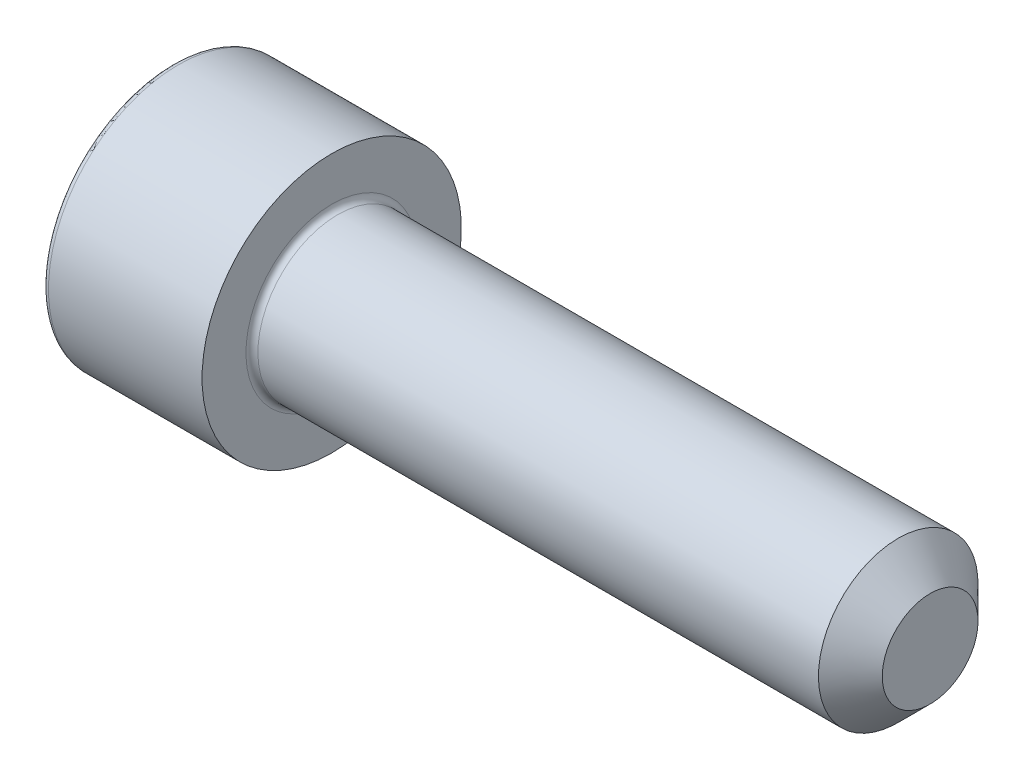
ISO-10303-21;
HEADER;
FILE_DESCRIPTION(('STEP AP214'),'2;1');
FILE_NAME('part.step','',(''),(''),'','','');
FILE_SCHEMA(('AUTOMOTIVE_DESIGN { 1 0 10303 214 1 1 1 1 }'));
ENDSEC;
DATA;
#1=APPLICATION_CONTEXT('core data for automotive mechanical design processes');
#2=APPLICATION_PROTOCOL_DEFINITION('international standard','automotive_design',2000,#1);
#3=PRODUCT_CONTEXT('',#1,'mechanical');
#4=PRODUCT('Part','Part','',(#3));
#5=PRODUCT_RELATED_PRODUCT_CATEGORY('part','',(#4));
#6=PRODUCT_DEFINITION_FORMATION('','',#4);
#7=PRODUCT_DEFINITION_CONTEXT('part definition',#1,'design');
#8=PRODUCT_DEFINITION('design','',#6,#7);
#9=PRODUCT_DEFINITION_SHAPE('','',#8);
#10=(LENGTH_UNIT() NAMED_UNIT(*) SI_UNIT(.MILLI.,.METRE.));
#11=(NAMED_UNIT(*) PLANE_ANGLE_UNIT() SI_UNIT($,.RADIAN.));
#12=(NAMED_UNIT(*) SI_UNIT($,.STERADIAN.) SOLID_ANGLE_UNIT());
#13=UNCERTAINTY_MEASURE_WITH_UNIT(LENGTH_MEASURE(1.E-05),#10,'distance_accuracy_value','');
#14=(GEOMETRIC_REPRESENTATION_CONTEXT(3) GLOBAL_UNCERTAINTY_ASSIGNED_CONTEXT((#13)) GLOBAL_UNIT_ASSIGNED_CONTEXT((#10,
#11,#12)) REPRESENTATION_CONTEXT('',''));
#15=CARTESIAN_POINT('',(0.,0.,0.));
#16=DIRECTION('',(0.,0.,1.));
#17=DIRECTION('',(1.,0.,0.));
#18=AXIS2_PLACEMENT_3D('',#15,#16,#17);
#19=CARTESIAN_POINT('',(0.,0.,0.));
#20=DIRECTION('',(-1.,0.,0.));
#21=DIRECTION('',(0.,-1.,0.));
#22=AXIS2_PLACEMENT_3D('',#19,#20,#21);
#23=PLANE('',#22);
#24=CARTESIAN_POINT('',(0.,0.,0.));
#25=DIRECTION('',(-1.,0.,0.));
#26=DIRECTION('',(0.,-1.,0.));
#27=AXIS2_PLACEMENT_3D('',#24,#25,#26);
#28=CIRCLE('',#27,6.2);
#29=CARTESIAN_POINT('',(0.,-6.2,0.));
#30=VERTEX_POINT('',#29);
#31=EDGE_CURVE('E158',#30,#30,#28,.T.);
#32=ORIENTED_EDGE('',*,*,#31,.T.);
#33=EDGE_LOOP('',(#32));
#34=FACE_BOUND('',#33,.T.);
#35=DIRECTION('',(0.,0.,-1.));
#36=VECTOR('',#35,1.);
#37=CARTESIAN_POINT('',(0.,3.,1.73205080756888));
#38=LINE('',#37,#36);
#39=CARTESIAN_POINT('',(0.,3.,1.73205080756888));
#40=VERTEX_POINT('',#39);
#41=CARTESIAN_POINT('',(0.,3.,-1.73205080756888));
#42=VERTEX_POINT('',#41);
#43=EDGE_CURVE('E54',#40,#42,#38,.T.);
#44=ORIENTED_EDGE('',*,*,#43,.F.);
#45=DIRECTION('',(0.,0.866025403784439,-0.5));
#46=VECTOR('',#45,1.);
#47=CARTESIAN_POINT('',(0.,0.,3.46410161513775));
#48=LINE('',#47,#46);
#49=CARTESIAN_POINT('',(0.,0.,3.46410161513775));
#50=VERTEX_POINT('',#49);
#51=EDGE_CURVE('E137',#50,#40,#48,.T.);
#52=ORIENTED_EDGE('',*,*,#51,.F.);
#53=DIRECTION('',(0.,0.866025403784439,0.5));
#54=VECTOR('',#53,1.);
#55=CARTESIAN_POINT('',(0.,-3.,1.73205080756888));
#56=LINE('',#55,#54);
#57=CARTESIAN_POINT('',(0.,-3.,1.73205080756888));
#58=VERTEX_POINT('',#57);
#59=EDGE_CURVE('E135',#58,#50,#56,.T.);
#60=ORIENTED_EDGE('',*,*,#59,.F.);
#61=DIRECTION('',(0.,0.,1.));
#62=VECTOR('',#61,1.);
#63=CARTESIAN_POINT('',(0.,-3.,-1.73205080756888));
#64=LINE('',#63,#62);
#65=CARTESIAN_POINT('',(0.,-3.,-1.73205080756888));
#66=VERTEX_POINT('',#65);
#67=EDGE_CURVE('E102',#66,#58,#64,.T.);
#68=ORIENTED_EDGE('',*,*,#67,.F.);
#69=DIRECTION('',(0.,-0.866025403784439,0.5));
#70=VECTOR('',#69,1.);
#71=CARTESIAN_POINT('',(0.,0.,-3.46410161513775));
#72=LINE('',#71,#70);
#73=CARTESIAN_POINT('',(0.,0.,-3.46410161513775));
#74=VERTEX_POINT('',#73);
#75=EDGE_CURVE('E131',#74,#66,#72,.T.);
#76=ORIENTED_EDGE('',*,*,#75,.F.);
#77=DIRECTION('',(0.,-0.866025403784438,-0.5));
#78=VECTOR('',#77,1.);
#79=CARTESIAN_POINT('',(0.,3.,-1.73205080756888));
#80=LINE('',#79,#78);
#81=EDGE_CURVE('E128',#42,#74,#80,.T.);
#82=ORIENTED_EDGE('',*,*,#81,.F.);
#83=EDGE_LOOP('',(#44,#52,#60,#68,#76,#82));
#84=FACE_BOUND('',#83,.T.);
#85=ADVANCED_FACE('F38',(#34,#84),#23,.T.);
#86=CARTESIAN_POINT('',(38.,0.,0.));
#87=DIRECTION('',(1.,0.,0.));
#88=DIRECTION('',(0.,1.,0.));
#89=AXIS2_PLACEMENT_3D('',#86,#87,#88);
#90=CYLINDRICAL_SURFACE('',#89,6.5);
#91=CARTESIAN_POINT('',(0.300000000000002,0.,0.));
#92=DIRECTION('',(-1.,0.,0.));
#93=DIRECTION('',(0.,-1.,0.));
#94=AXIS2_PLACEMENT_3D('',#91,#92,#93);
#95=CIRCLE('',#94,6.5);
#96=CARTESIAN_POINT('',(0.300000000000003,-6.5,0.));
#97=VERTEX_POINT('',#96);
#98=EDGE_CURVE('E155',#97,#97,#95,.F.);
#99=ORIENTED_EDGE('',*,*,#98,.T.);
#100=EDGE_LOOP('',(#99));
#101=FACE_BOUND('',#100,.T.);
#102=CARTESIAN_POINT('',(8.,0.,0.));
#103=DIRECTION('',(1.,0.,0.));
#104=DIRECTION('',(0.,1.,0.));
#105=AXIS2_PLACEMENT_3D('',#102,#103,#104);
#106=CIRCLE('',#105,6.49999999999999);
#107=CARTESIAN_POINT('',(8.,6.5,0.));
#108=VERTEX_POINT('',#107);
#109=EDGE_CURVE('E141',#108,#108,#106,.T.);
#110=ORIENTED_EDGE('',*,*,#109,.F.);
#111=EDGE_LOOP('',(#110));
#112=FACE_BOUND('',#111,.T.);
#113=ADVANCED_FACE('F175',(#101,#112),#90,.T.);
#114=CARTESIAN_POINT('',(8.,6.5,0.));
#115=DIRECTION('',(1.,0.,0.));
#116=DIRECTION('',(0.,1.,0.));
#117=AXIS2_PLACEMENT_3D('',#114,#115,#116);
#118=PLANE('',#117);
#119=CARTESIAN_POINT('',(8.,0.,0.));
#120=DIRECTION('',(1.,0.,0.));
#121=DIRECTION('',(0.,1.,0.));
#122=AXIS2_PLACEMENT_3D('',#119,#120,#121);
#123=CIRCLE('',#122,4.29999999999999);
#124=CARTESIAN_POINT('',(8.,4.29999999999999,0.));
#125=VERTEX_POINT('',#124);
#126=EDGE_CURVE('E152',#125,#125,#123,.F.);
#127=ORIENTED_EDGE('',*,*,#126,.T.);
#128=EDGE_LOOP('',(#127));
#129=FACE_BOUND('',#128,.T.);
#130=ORIENTED_EDGE('',*,*,#109,.T.);
#131=EDGE_LOOP('',(#130));
#132=FACE_BOUND('',#131,.T.);
#133=ADVANCED_FACE('F181',(#129,#132),#118,.T.);
#134=CARTESIAN_POINT('',(38.,0.,0.));
#135=DIRECTION('',(1.,0.,0.));
#136=DIRECTION('',(0.,1.,0.));
#137=AXIS2_PLACEMENT_3D('',#134,#135,#136);
#138=CYLINDRICAL_SURFACE('',#137,3.99999999999999);
#139=CARTESIAN_POINT('',(36.4,0.,0.));
#140=DIRECTION('',(1.,0.,0.));
#141=DIRECTION('',(0.,1.,0.));
#142=AXIS2_PLACEMENT_3D('',#139,#140,#141);
#143=CIRCLE('',#142,3.99999999999999);
#144=CARTESIAN_POINT('',(36.4,4.,0.));
#145=VERTEX_POINT('',#144);
#146=EDGE_CURVE('E11',#145,#145,#143,.F.);
#147=ORIENTED_EDGE('',*,*,#146,.T.);
#148=EDGE_LOOP('',(#147));
#149=FACE_BOUND('',#148,.T.);
#150=CARTESIAN_POINT('',(8.3,0.,0.));
#151=DIRECTION('',(1.,0.,0.));
#152=DIRECTION('',(0.,1.,0.));
#153=AXIS2_PLACEMENT_3D('',#150,#151,#152);
#154=CIRCLE('',#153,3.99999999999999);
#155=CARTESIAN_POINT('',(8.3,3.99999999999999,0.));
#156=VERTEX_POINT('',#155);
#157=EDGE_CURVE('E149',#156,#156,#154,.T.);
#158=ORIENTED_EDGE('',*,*,#157,.T.);
#159=EDGE_LOOP('',(#158));
#160=FACE_BOUND('',#159,.T.);
#161=ADVANCED_FACE('F198',(#149,#160),#138,.T.);
#162=CARTESIAN_POINT('',(38.,4.,0.));
#163=DIRECTION('',(1.,0.,0.));
#164=DIRECTION('',(0.,1.,0.));
#165=AXIS2_PLACEMENT_3D('',#162,#163,#164);
#166=PLANE('',#165);
#167=CARTESIAN_POINT('',(38.,0.,0.));
#168=DIRECTION('',(1.,0.,0.));
#169=DIRECTION('',(0.,1.,0.));
#170=AXIS2_PLACEMENT_3D('',#167,#168,#169);
#171=CIRCLE('',#170,2.39999999999999);
#172=CARTESIAN_POINT('',(38.,2.4,0.));
#173=VERTEX_POINT('',#172);
#174=EDGE_CURVE('E47',#173,#173,#171,.T.);
#175=ORIENTED_EDGE('',*,*,#174,.T.);
#176=EDGE_LOOP('',(#175));
#177=FACE_BOUND('',#176,.T.);
#178=ADVANCED_FACE('F163',(#177),#166,.T.);
#179=CARTESIAN_POINT('',(2.5,3.,1.73205080756888));
#180=DIRECTION('',(0.,1.,0.));
#181=DIRECTION('',(-1.,0.,0.));
#182=AXIS2_PLACEMENT_3D('',#179,#180,#181);
#183=PLANE('',#182);
#184=ORIENTED_EDGE('',*,*,#43,.T.);
#185=DIRECTION('',(-1.,0.,0.));
#186=VECTOR('',#185,1.);
#187=CARTESIAN_POINT('',(2.5,3.,-1.73205080756888));
#188=LINE('',#187,#186);
#189=CARTESIAN_POINT('',(2.5,3.,-1.73205080756888));
#190=VERTEX_POINT('',#189);
#191=EDGE_CURVE('E84',#190,#42,#188,.T.);
#192=ORIENTED_EDGE('',*,*,#191,.F.);
#193=DIRECTION('',(0.,0.,-1.));
#194=VECTOR('',#193,1.);
#195=CARTESIAN_POINT('',(2.5,3.,1.73205080756888));
#196=LINE('',#195,#194);
#197=CARTESIAN_POINT('',(2.5,3.,1.73205080756888));
#198=VERTEX_POINT('',#197);
#199=EDGE_CURVE('E139',#198,#190,#196,.T.);
#200=ORIENTED_EDGE('',*,*,#199,.F.);
#201=DIRECTION('',(-1.,0.,0.));
#202=VECTOR('',#201,1.);
#203=CARTESIAN_POINT('',(2.5,3.,1.73205080756888));
#204=LINE('',#203,#202);
#205=EDGE_CURVE('E62',#198,#40,#204,.T.);
#206=ORIENTED_EDGE('',*,*,#205,.T.);
#207=EDGE_LOOP('',(#184,#192,#200,#206));
#208=FACE_BOUND('',#207,.T.);
#209=ADVANCED_FACE('F206',(#208),#183,.F.);
#210=CARTESIAN_POINT('',(2.5,0.,3.46410161513775));
#211=DIRECTION('',(0.,0.5,0.866025403784439));
#212=DIRECTION('',(0.,-0.866025403784439,0.5));
#213=AXIS2_PLACEMENT_3D('',#210,#211,#212);
#214=PLANE('',#213);
#215=ORIENTED_EDGE('',*,*,#51,.T.);
#216=ORIENTED_EDGE('',*,*,#205,.F.);
#217=DIRECTION('',(0.,0.866025403784439,-0.5));
#218=VECTOR('',#217,1.);
#219=CARTESIAN_POINT('',(2.5,0.,3.46410161513775));
#220=LINE('',#219,#218);
#221=CARTESIAN_POINT('',(2.5,0.,3.46410161513775));
#222=VERTEX_POINT('',#221);
#223=EDGE_CURVE('E114',#222,#198,#220,.T.);
#224=ORIENTED_EDGE('',*,*,#223,.F.);
#225=DIRECTION('',(-1.,0.,0.));
#226=VECTOR('',#225,1.);
#227=CARTESIAN_POINT('',(2.5,0.,3.46410161513775));
#228=LINE('',#227,#226);
#229=EDGE_CURVE('E106',#222,#50,#228,.T.);
#230=ORIENTED_EDGE('',*,*,#229,.T.);
#231=EDGE_LOOP('',(#215,#216,#224,#230));
#232=FACE_BOUND('',#231,.T.);
#233=ADVANCED_FACE('F212',(#232),#214,.F.);
#234=CARTESIAN_POINT('',(2.5,-3.,1.73205080756888));
#235=DIRECTION('',(0.,-0.5,0.866025403784439));
#236=DIRECTION('',(0.,-0.866025403784439,-0.5));
#237=AXIS2_PLACEMENT_3D('',#234,#235,#236);
#238=PLANE('',#237);
#239=ORIENTED_EDGE('',*,*,#59,.T.);
#240=ORIENTED_EDGE('',*,*,#229,.F.);
#241=DIRECTION('',(0.,0.866025403784439,0.5));
#242=VECTOR('',#241,1.);
#243=CARTESIAN_POINT('',(2.5,-3.,1.73205080756888));
#244=LINE('',#243,#242);
#245=CARTESIAN_POINT('',(2.5,-3.,1.73205080756888));
#246=VERTEX_POINT('',#245);
#247=EDGE_CURVE('E110',#246,#222,#244,.T.);
#248=ORIENTED_EDGE('',*,*,#247,.F.);
#249=DIRECTION('',(-1.,0.,0.));
#250=VECTOR('',#249,1.);
#251=CARTESIAN_POINT('',(2.5,-3.,1.73205080756888));
#252=LINE('',#251,#250);
#253=EDGE_CURVE('E95',#246,#58,#252,.T.);
#254=ORIENTED_EDGE('',*,*,#253,.T.);
#255=EDGE_LOOP('',(#239,#240,#248,#254));
#256=FACE_BOUND('',#255,.T.);
#257=ADVANCED_FACE('F111',(#256),#238,.F.);
#258=CARTESIAN_POINT('',(2.5,-3.,-1.73205080756888));
#259=DIRECTION('',(0.,-1.,0.));
#260=DIRECTION('',(0.,0.,-1.));
#261=AXIS2_PLACEMENT_3D('',#258,#259,#260);
#262=PLANE('',#261);
#263=ORIENTED_EDGE('',*,*,#67,.T.);
#264=ORIENTED_EDGE('',*,*,#253,.F.);
#265=DIRECTION('',(0.,0.,1.));
#266=VECTOR('',#265,1.);
#267=CARTESIAN_POINT('',(2.5,-3.,-1.73205080756888));
#268=LINE('',#267,#266);
#269=CARTESIAN_POINT('',(2.5,-3.,-1.73205080756888));
#270=VERTEX_POINT('',#269);
#271=EDGE_CURVE('E99',#270,#246,#268,.T.);
#272=ORIENTED_EDGE('',*,*,#271,.F.);
#273=DIRECTION('',(-1.,0.,0.));
#274=VECTOR('',#273,1.);
#275=CARTESIAN_POINT('',(2.5,-3.,-1.73205080756888));
#276=LINE('',#275,#274);
#277=EDGE_CURVE('E107',#270,#66,#276,.T.);
#278=ORIENTED_EDGE('',*,*,#277,.T.);
#279=EDGE_LOOP('',(#263,#264,#272,#278));
#280=FACE_BOUND('',#279,.T.);
#281=ADVANCED_FACE('F97',(#280),#262,.F.);
#282=CARTESIAN_POINT('',(2.5,0.,-3.46410161513775));
#283=DIRECTION('',(0.,-0.5,-0.866025403784439));
#284=DIRECTION('',(0.,0.866025403784439,-0.5));
#285=AXIS2_PLACEMENT_3D('',#282,#283,#284);
#286=PLANE('',#285);
#287=ORIENTED_EDGE('',*,*,#75,.T.);
#288=ORIENTED_EDGE('',*,*,#277,.F.);
#289=DIRECTION('',(0.,-0.866025403784439,0.5));
#290=VECTOR('',#289,1.);
#291=CARTESIAN_POINT('',(2.5,0.,-3.46410161513775));
#292=LINE('',#291,#290);
#293=CARTESIAN_POINT('',(2.5,0.,-3.46410161513775));
#294=VERTEX_POINT('',#293);
#295=EDGE_CURVE('E120',#294,#270,#292,.T.);
#296=ORIENTED_EDGE('',*,*,#295,.F.);
#297=DIRECTION('',(-1.,0.,0.));
#298=VECTOR('',#297,1.);
#299=CARTESIAN_POINT('',(2.5,0.,-3.46410161513775));
#300=LINE('',#299,#298);
#301=EDGE_CURVE('E144',#294,#74,#300,.T.);
#302=ORIENTED_EDGE('',*,*,#301,.T.);
#303=EDGE_LOOP('',(#287,#288,#296,#302));
#304=FACE_BOUND('',#303,.T.);
#305=ADVANCED_FACE('F215',(#304),#286,.F.);
#306=CARTESIAN_POINT('',(2.5,3.,-1.73205080756888));
#307=DIRECTION('',(0.,0.5,-0.866025403784439));
#308=DIRECTION('',(0.,0.866025403784439,0.5));
#309=AXIS2_PLACEMENT_3D('',#306,#307,#308);
#310=PLANE('',#309);
#311=ORIENTED_EDGE('',*,*,#81,.T.);
#312=ORIENTED_EDGE('',*,*,#301,.F.);
#313=DIRECTION('',(0.,-0.866025403784438,-0.5));
#314=VECTOR('',#313,1.);
#315=CARTESIAN_POINT('',(2.5,3.,-1.73205080756888));
#316=LINE('',#315,#314);
#317=EDGE_CURVE('E122',#190,#294,#316,.T.);
#318=ORIENTED_EDGE('',*,*,#317,.F.);
#319=ORIENTED_EDGE('',*,*,#191,.T.);
#320=EDGE_LOOP('',(#311,#312,#318,#319));
#321=FACE_BOUND('',#320,.T.);
#322=ADVANCED_FACE('F192',(#321),#310,.F.);
#323=CARTESIAN_POINT('',(2.5,0.,0.));
#324=DIRECTION('',(-1.,0.,0.));
#325=DIRECTION('',(0.,-1.,0.));
#326=AXIS2_PLACEMENT_3D('',#323,#324,#325);
#327=PLANE('',#326);
#328=ORIENTED_EDGE('',*,*,#199,.T.);
#329=ORIENTED_EDGE('',*,*,#317,.T.);
#330=ORIENTED_EDGE('',*,*,#295,.T.);
#331=ORIENTED_EDGE('',*,*,#271,.T.);
#332=ORIENTED_EDGE('',*,*,#247,.T.);
#333=ORIENTED_EDGE('',*,*,#223,.T.);
#334=EDGE_LOOP('',(#328,#329,#330,#331,#332,#333));
#335=FACE_BOUND('',#334,.T.);
#336=ADVANCED_FACE('F117',(#335),#327,.T.);
#337=CARTESIAN_POINT('',(8.3,0.,0.));
#338=DIRECTION('',(1.,0.,0.));
#339=DIRECTION('',(0.,1.,0.));
#340=AXIS2_PLACEMENT_3D('',#337,#338,#339);
#341=TOROIDAL_SURFACE('',#340,4.29999999999999,0.3);
#342=ORIENTED_EDGE('',*,*,#126,.F.);
#343=EDGE_LOOP('',(#342));
#344=FACE_BOUND('',#343,.T.);
#345=ORIENTED_EDGE('',*,*,#157,.F.);
#346=EDGE_LOOP('',(#345));
#347=FACE_BOUND('',#346,.T.);
#348=ADVANCED_FACE('F171',(#344,#347),#341,.F.);
#349=CARTESIAN_POINT('',(0.300000000000002,0.,0.));
#350=DIRECTION('',(-1.,0.,0.));
#351=DIRECTION('',(0.,-1.,0.));
#352=AXIS2_PLACEMENT_3D('',#349,#350,#351);
#353=TOROIDAL_SURFACE('',#352,6.2,0.3);
#354=ORIENTED_EDGE('',*,*,#31,.F.);
#355=EDGE_LOOP('',(#354));
#356=FACE_BOUND('',#355,.T.);
#357=ORIENTED_EDGE('',*,*,#98,.F.);
#358=EDGE_LOOP('',(#357));
#359=FACE_BOUND('',#358,.T.);
#360=ADVANCED_FACE('F166',(#356,#359),#353,.T.);
#361=CARTESIAN_POINT('',(38.,0.,0.));
#362=DIRECTION('',(-1.,0.,0.));
#363=DIRECTION('',(0.,-1.,0.));
#364=AXIS2_PLACEMENT_3D('',#361,#362,#363);
#365=CONICAL_SURFACE('',#364,2.39999999999999,0.785398163397448);
#366=ORIENTED_EDGE('',*,*,#146,.F.);
#367=EDGE_LOOP('',(#366));
#368=FACE_BOUND('',#367,.T.);
#369=ORIENTED_EDGE('',*,*,#174,.F.);
#370=EDGE_LOOP('',(#369));
#371=FACE_BOUND('',#370,.T.);
#372=ADVANCED_FACE('F41',(#368,#371),#365,.T.);
#373=CLOSED_SHELL('',(#85,#113,#133,#161,#178,#209,#233,#257,#281,#305,#322,#336,#348,#360,#372));
#374=MANIFOLD_SOLID_BREP('B2',#373);
#375=ADVANCED_BREP_SHAPE_REPRESENTATION('',(#18,#374),#14);
#376=SHAPE_DEFINITION_REPRESENTATION(#9,#375);
ENDSEC;
END-ISO-10303-21;
